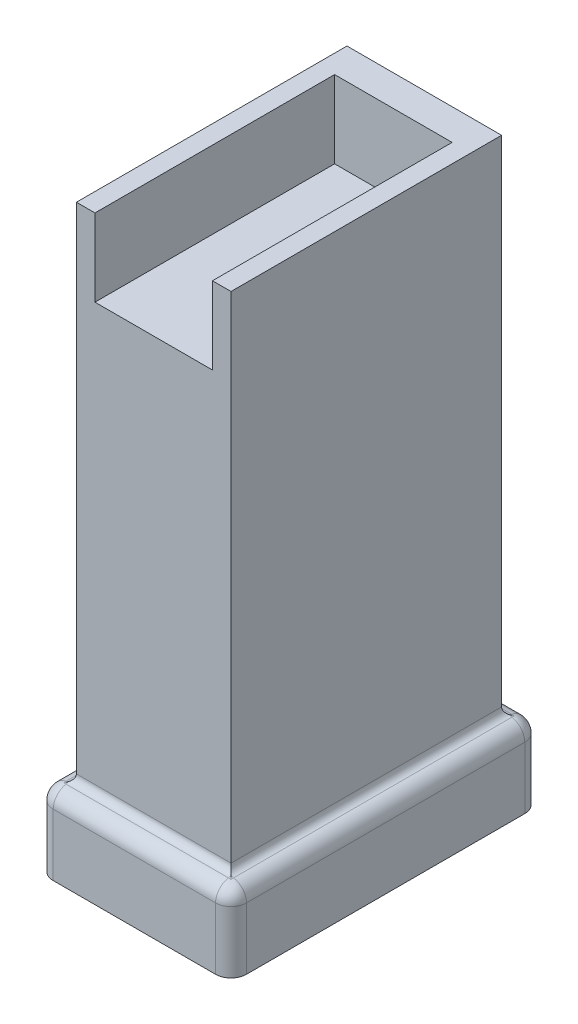
ISO-10303-21;
HEADER;
FILE_DESCRIPTION(('STEP AP214'),'2;1');
FILE_NAME('part.step','',(''),(''),'','','');
FILE_SCHEMA(('AUTOMOTIVE_DESIGN { 1 0 10303 214 1 1 1 1 }'));
ENDSEC;
DATA;
#1=APPLICATION_CONTEXT('core data for automotive mechanical design processes');
#2=APPLICATION_PROTOCOL_DEFINITION('international standard','automotive_design',2000,#1);
#3=PRODUCT_CONTEXT('',#1,'mechanical');
#4=PRODUCT('Part','Part','',(#3));
#5=PRODUCT_RELATED_PRODUCT_CATEGORY('part','',(#4));
#6=PRODUCT_DEFINITION_FORMATION('','',#4);
#7=PRODUCT_DEFINITION_CONTEXT('part definition',#1,'design');
#8=PRODUCT_DEFINITION('design','',#6,#7);
#9=PRODUCT_DEFINITION_SHAPE('','',#8);
#10=(LENGTH_UNIT() NAMED_UNIT(*) SI_UNIT(.MILLI.,.METRE.));
#11=(NAMED_UNIT(*) PLANE_ANGLE_UNIT() SI_UNIT($,.RADIAN.));
#12=(NAMED_UNIT(*) SI_UNIT($,.STERADIAN.) SOLID_ANGLE_UNIT());
#13=UNCERTAINTY_MEASURE_WITH_UNIT(LENGTH_MEASURE(1.E-05),#10,'distance_accuracy_value','');
#14=(GEOMETRIC_REPRESENTATION_CONTEXT(3) GLOBAL_UNCERTAINTY_ASSIGNED_CONTEXT((#13)) GLOBAL_UNIT_ASSIGNED_CONTEXT((#10,
#11,#12)) REPRESENTATION_CONTEXT('',''));
#15=CARTESIAN_POINT('',(0.,0.,0.));
#16=DIRECTION('',(0.,0.,1.));
#17=DIRECTION('',(1.,0.,0.));
#18=AXIS2_PLACEMENT_3D('',#15,#16,#17);
#19=CARTESIAN_POINT('',(-12.5,10.,20.));
#20=DIRECTION('',(1.,0.,0.));
#21=DIRECTION('',(0.,0.,-1.));
#22=AXIS2_PLACEMENT_3D('',#19,#20,#21);
#23=PLANE('',#22);
#24=DIRECTION('',(0.,0.,1.));
#25=VECTOR('',#24,1.);
#26=CARTESIAN_POINT('',(-12.5,8.,-20.));
#27=LINE('',#26,#25);
#28=CARTESIAN_POINT('',(-12.5,8.,18.));
#29=VERTEX_POINT('',#28);
#30=CARTESIAN_POINT('',(-12.5,8.,-18.));
#31=VERTEX_POINT('',#30);
#32=EDGE_CURVE('E590',#29,#31,#27,.F.);
#33=ORIENTED_EDGE('',*,*,#32,.T.);
#34=DIRECTION('',(0.,-1.,0.));
#35=VECTOR('',#34,1.);
#36=CARTESIAN_POINT('',(-12.5,10.,-18.));
#37=LINE('',#36,#35);
#38=CARTESIAN_POINT('',(-12.5,0.,-18.));
#39=VERTEX_POINT('',#38);
#40=EDGE_CURVE('E408',#31,#39,#37,.T.);
#41=ORIENTED_EDGE('',*,*,#40,.T.);
#42=DIRECTION('',(0.,0.,1.));
#43=VECTOR('',#42,1.);
#44=CARTESIAN_POINT('',(-12.5,0.,20.));
#45=LINE('',#44,#43);
#46=CARTESIAN_POINT('',(-12.5,0.,18.));
#47=VERTEX_POINT('',#46);
#48=EDGE_CURVE('E463',#39,#47,#45,.T.);
#49=ORIENTED_EDGE('',*,*,#48,.T.);
#50=DIRECTION('',(0.,-1.,0.));
#51=VECTOR('',#50,1.);
#52=CARTESIAN_POINT('',(-12.5,10.,18.));
#53=LINE('',#52,#51);
#54=EDGE_CURVE('E586',#47,#29,#53,.F.);
#55=ORIENTED_EDGE('',*,*,#54,.T.);
#56=EDGE_LOOP('',(#33,#41,#49,#55));
#57=FACE_BOUND('',#56,.T.);
#58=ADVANCED_FACE('F45',(#57),#23,.F.);
#59=CARTESIAN_POINT('',(12.5,10.,20.));
#60=DIRECTION('',(0.,0.,-1.));
#61=DIRECTION('',(-1.,0.,0.));
#62=AXIS2_PLACEMENT_3D('',#59,#60,#61);
#63=PLANE('',#62);
#64=DIRECTION('',(1.,0.,0.));
#65=VECTOR('',#64,1.);
#66=CARTESIAN_POINT('',(12.5,0.,20.));
#67=LINE('',#66,#65);
#68=CARTESIAN_POINT('',(-10.5,0.,20.));
#69=VERTEX_POINT('',#68);
#70=CARTESIAN_POINT('',(10.5,0.,20.));
#71=VERTEX_POINT('',#70);
#72=EDGE_CURVE('E549',#69,#71,#67,.T.);
#73=ORIENTED_EDGE('',*,*,#72,.T.);
#74=DIRECTION('',(0.,-1.,0.));
#75=VECTOR('',#74,1.);
#76=CARTESIAN_POINT('',(10.5,10.,20.));
#77=LINE('',#76,#75);
#78=CARTESIAN_POINT('',(10.5,8.,20.));
#79=VERTEX_POINT('',#78);
#80=EDGE_CURVE('E567',#71,#79,#77,.F.);
#81=ORIENTED_EDGE('',*,*,#80,.T.);
#82=DIRECTION('',(1.,0.,0.));
#83=VECTOR('',#82,1.);
#84=CARTESIAN_POINT('',(-12.5,8.,20.));
#85=LINE('',#84,#83);
#86=CARTESIAN_POINT('',(-10.5,8.,20.));
#87=VERTEX_POINT('',#86);
#88=EDGE_CURVE('E563',#79,#87,#85,.F.);
#89=ORIENTED_EDGE('',*,*,#88,.T.);
#90=DIRECTION('',(0.,-1.,0.));
#91=VECTOR('',#90,1.);
#92=CARTESIAN_POINT('',(-10.5,10.,20.));
#93=LINE('',#92,#91);
#94=EDGE_CURVE('E560',#87,#69,#93,.T.);
#95=ORIENTED_EDGE('',*,*,#94,.T.);
#96=EDGE_LOOP('',(#73,#81,#89,#95));
#97=FACE_BOUND('',#96,.T.);
#98=ADVANCED_FACE('F342',(#97),#63,.F.);
#99=CARTESIAN_POINT('',(12.5,10.,20.));
#100=DIRECTION('',(-1.,0.,0.));
#101=DIRECTION('',(0.,0.,1.));
#102=AXIS2_PLACEMENT_3D('',#99,#100,#101);
#103=PLANE('',#102);
#104=DIRECTION('',(0.,0.,-1.));
#105=VECTOR('',#104,1.);
#106=CARTESIAN_POINT('',(12.5,0.,20.));
#107=LINE('',#106,#105);
#108=CARTESIAN_POINT('',(12.5,0.,18.));
#109=VERTEX_POINT('',#108);
#110=CARTESIAN_POINT('',(12.5,0.,-18.));
#111=VERTEX_POINT('',#110);
#112=EDGE_CURVE('E553',#109,#111,#107,.T.);
#113=ORIENTED_EDGE('',*,*,#112,.T.);
#114=DIRECTION('',(0.,-1.,0.));
#115=VECTOR('',#114,1.);
#116=CARTESIAN_POINT('',(12.5,10.,-18.));
#117=LINE('',#116,#115);
#118=CARTESIAN_POINT('',(12.5,8.,-18.));
#119=VERTEX_POINT('',#118);
#120=EDGE_CURVE('E576',#111,#119,#117,.F.);
#121=ORIENTED_EDGE('',*,*,#120,.T.);
#122=DIRECTION('',(0.,0.,-1.));
#123=VECTOR('',#122,1.);
#124=CARTESIAN_POINT('',(12.5,8.,20.));
#125=LINE('',#124,#123);
#126=CARTESIAN_POINT('',(12.5,8.,18.));
#127=VERTEX_POINT('',#126);
#128=EDGE_CURVE('E573',#119,#127,#125,.F.);
#129=ORIENTED_EDGE('',*,*,#128,.T.);
#130=DIRECTION('',(0.,-1.,0.));
#131=VECTOR('',#130,1.);
#132=CARTESIAN_POINT('',(12.5,10.,18.));
#133=LINE('',#132,#131);
#134=EDGE_CURVE('E570',#127,#109,#133,.T.);
#135=ORIENTED_EDGE('',*,*,#134,.T.);
#136=EDGE_LOOP('',(#113,#121,#129,#135));
#137=FACE_BOUND('',#136,.T.);
#138=ADVANCED_FACE('F348',(#137),#103,.F.);
#139=CARTESIAN_POINT('',(12.5,10.,-20.));
#140=DIRECTION('',(0.,0.,1.));
#141=DIRECTION('',(1.,0.,0.));
#142=AXIS2_PLACEMENT_3D('',#139,#140,#141);
#143=PLANE('',#142);
#144=DIRECTION('',(-1.,0.,0.));
#145=VECTOR('',#144,1.);
#146=CARTESIAN_POINT('',(12.5,0.,-20.));
#147=LINE('',#146,#145);
#148=CARTESIAN_POINT('',(10.5,0.,-20.));
#149=VERTEX_POINT('',#148);
#150=CARTESIAN_POINT('',(-10.5,0.,-20.));
#151=VERTEX_POINT('',#150);
#152=EDGE_CURVE('E557',#149,#151,#147,.T.);
#153=ORIENTED_EDGE('',*,*,#152,.T.);
#154=DIRECTION('',(0.,-1.,0.));
#155=VECTOR('',#154,1.);
#156=CARTESIAN_POINT('',(-10.5,10.,-20.));
#157=LINE('',#156,#155);
#158=CARTESIAN_POINT('',(-10.5,8.,-20.));
#159=VERTEX_POINT('',#158);
#160=EDGE_CURVE('E409',#151,#159,#157,.F.);
#161=ORIENTED_EDGE('',*,*,#160,.T.);
#162=DIRECTION('',(-1.,0.,0.));
#163=VECTOR('',#162,1.);
#164=CARTESIAN_POINT('',(12.5,8.,-20.));
#165=LINE('',#164,#163);
#166=CARTESIAN_POINT('',(10.5,8.,-20.));
#167=VERTEX_POINT('',#166);
#168=EDGE_CURVE('E229',#159,#167,#165,.F.);
#169=ORIENTED_EDGE('',*,*,#168,.T.);
#170=DIRECTION('',(0.,-1.,0.));
#171=VECTOR('',#170,1.);
#172=CARTESIAN_POINT('',(10.5,10.,-20.));
#173=LINE('',#172,#171);
#174=EDGE_CURVE('E579',#167,#149,#173,.T.);
#175=ORIENTED_EDGE('',*,*,#174,.T.);
#176=EDGE_LOOP('',(#153,#161,#169,#175));
#177=FACE_BOUND('',#176,.T.);
#178=ADVANCED_FACE('F401',(#177),#143,.F.);
#179=CARTESIAN_POINT('',(0.,0.,0.));
#180=DIRECTION('',(0.,1.,0.));
#181=DIRECTION('',(0.,0.,1.));
#182=AXIS2_PLACEMENT_3D('',#179,#180,#181);
#183=PLANE('',#182);
#184=ORIENTED_EDGE('',*,*,#48,.F.);
#185=CARTESIAN_POINT('',(-10.5,0.,-18.));
#186=DIRECTION('',(0.,1.,0.));
#187=DIRECTION('',(0.,0.,1.));
#188=AXIS2_PLACEMENT_3D('',#185,#186,#187);
#189=CIRCLE('',#188,2.);
#190=EDGE_CURVE('E407',#39,#151,#189,.F.);
#191=ORIENTED_EDGE('',*,*,#190,.T.);
#192=ORIENTED_EDGE('',*,*,#152,.F.);
#193=CARTESIAN_POINT('',(10.5,0.,-18.));
#194=DIRECTION('',(0.,1.,0.));
#195=DIRECTION('',(0.,0.,1.));
#196=AXIS2_PLACEMENT_3D('',#193,#194,#195);
#197=CIRCLE('',#196,2.);
#198=EDGE_CURVE('E415',#149,#111,#197,.F.);
#199=ORIENTED_EDGE('',*,*,#198,.T.);
#200=ORIENTED_EDGE('',*,*,#112,.F.);
#201=CARTESIAN_POINT('',(10.5,0.,18.));
#202=DIRECTION('',(0.,1.,0.));
#203=DIRECTION('',(0.,0.,1.));
#204=AXIS2_PLACEMENT_3D('',#201,#202,#203);
#205=CIRCLE('',#204,2.);
#206=EDGE_CURVE('E422',#109,#71,#205,.F.);
#207=ORIENTED_EDGE('',*,*,#206,.T.);
#208=ORIENTED_EDGE('',*,*,#72,.F.);
#209=CARTESIAN_POINT('',(-10.5,0.,18.));
#210=DIRECTION('',(0.,1.,0.));
#211=DIRECTION('',(0.,0.,1.));
#212=AXIS2_PLACEMENT_3D('',#209,#210,#211);
#213=CIRCLE('',#212,2.);
#214=EDGE_CURVE('E595',#69,#47,#213,.F.);
#215=ORIENTED_EDGE('',*,*,#214,.T.);
#216=EDGE_LOOP('',(#184,#191,#192,#199,#200,#207,#208,#215));
#217=FACE_BOUND('',#216,.T.);
#218=ADVANCED_FACE('F396',(#217),#183,.F.);
#219=CARTESIAN_POINT('',(-10.5,10.,-18.));
#220=DIRECTION('',(0.,-1.,0.));
#221=DIRECTION('',(0.,0.,-1.));
#222=AXIS2_PLACEMENT_3D('',#219,#220,#221);
#223=CYLINDRICAL_SURFACE('',#222,2.);
#224=ORIENTED_EDGE('',*,*,#190,.F.);
#225=ORIENTED_EDGE('',*,*,#40,.F.);
#226=CARTESIAN_POINT('',(-10.5,8.,-18.));
#227=DIRECTION('',(0.,1.,0.));
#228=DIRECTION('',(0.,0.,1.));
#229=AXIS2_PLACEMENT_3D('',#226,#227,#228);
#230=CIRCLE('',#229,2.);
#231=EDGE_CURVE('E232',#159,#31,#230,.T.);
#232=ORIENTED_EDGE('',*,*,#231,.F.);
#233=ORIENTED_EDGE('',*,*,#160,.F.);
#234=EDGE_LOOP('',(#224,#225,#232,#233));
#235=FACE_BOUND('',#234,.T.);
#236=ADVANCED_FACE('F394',(#235),#223,.T.);
#237=CARTESIAN_POINT('',(0.,8.,-18.));
#238=DIRECTION('',(1.,0.,0.));
#239=DIRECTION('',(0.,0.,-1.));
#240=AXIS2_PLACEMENT_3D('',#237,#238,#239);
#241=CYLINDRICAL_SURFACE('',#240,2.);
#242=CARTESIAN_POINT('',(-10.5,8.,-18.));
#243=DIRECTION('',(-1.,0.,0.));
#244=DIRECTION('',(0.,0.,1.));
#245=AXIS2_PLACEMENT_3D('',#242,#243,#244);
#246=CIRCLE('',#245,2.);
#247=CARTESIAN_POINT('',(-10.5,9.97202659436654,-18.3333333333333));
#248=VERTEX_POINT('',#247);
#249=EDGE_CURVE('E218',#248,#159,#246,.T.);
#250=ORIENTED_EDGE('',*,*,#249,.F.);
#251=DIRECTION('',(1.,0.,0.));
#252=VECTOR('',#251,1.);
#253=CARTESIAN_POINT('',(0.,9.97202659436654,-18.3333333333333));
#254=LINE('',#253,#252);
#255=CARTESIAN_POINT('',(10.5,9.97202659436654,-18.3333333333333));
#256=VERTEX_POINT('',#255);
#257=EDGE_CURVE('E221',#248,#256,#254,.T.);
#258=ORIENTED_EDGE('',*,*,#257,.T.);
#259=CARTESIAN_POINT('',(10.5,8.,-18.));
#260=DIRECTION('',(1.,0.,0.));
#261=DIRECTION('',(0.,0.,-1.));
#262=AXIS2_PLACEMENT_3D('',#259,#260,#261);
#263=CIRCLE('',#262,2.);
#264=EDGE_CURVE('E233',#167,#256,#263,.T.);
#265=ORIENTED_EDGE('',*,*,#264,.F.);
#266=ORIENTED_EDGE('',*,*,#168,.F.);
#267=EDGE_LOOP('',(#250,#258,#265,#266));
#268=FACE_BOUND('',#267,.T.);
#269=ADVANCED_FACE('F225',(#268),#241,.T.);
#270=CARTESIAN_POINT('',(10.5,10.,-18.));
#271=DIRECTION('',(0.,-1.,0.));
#272=DIRECTION('',(0.,0.,-1.));
#273=AXIS2_PLACEMENT_3D('',#270,#271,#272);
#274=CYLINDRICAL_SURFACE('',#273,2.);
#275=ORIENTED_EDGE('',*,*,#198,.F.);
#276=ORIENTED_EDGE('',*,*,#174,.F.);
#277=CARTESIAN_POINT('',(10.5,8.,-18.));
#278=DIRECTION('',(0.,1.,0.));
#279=DIRECTION('',(0.,0.,1.));
#280=AXIS2_PLACEMENT_3D('',#277,#278,#279);
#281=CIRCLE('',#280,2.);
#282=EDGE_CURVE('E456',#119,#167,#281,.T.);
#283=ORIENTED_EDGE('',*,*,#282,.F.);
#284=ORIENTED_EDGE('',*,*,#120,.F.);
#285=EDGE_LOOP('',(#275,#276,#283,#284));
#286=FACE_BOUND('',#285,.T.);
#287=ADVANCED_FACE('F389',(#286),#274,.T.);
#288=CARTESIAN_POINT('',(-10.5,8.,-18.));
#289=DIRECTION('',(0.,0.,-1.));
#290=DIRECTION('',(-1.,0.,0.));
#291=AXIS2_PLACEMENT_3D('',#288,#289,#290);
#292=SPHERICAL_SURFACE('',#291,2.);
#293=CARTESIAN_POINT('',(-10.8333333333333,8.,-18.));
#294=DIRECTION('',(1.,0.,0.));
#295=DIRECTION('',(0.,0.,-1.));
#296=AXIS2_PLACEMENT_3D('',#293,#294,#295);
#297=CIRCLE('',#296,1.97202659436654);
#298=CARTESIAN_POINT('',(-10.8333333333333,9.97202659436654,-18.));
#299=VERTEX_POINT('',#298);
#300=CARTESIAN_POINT('',(-10.8333333333333,9.9436506316151,-18.3333333333333));
#301=VERTEX_POINT('',#300);
#302=EDGE_CURVE('E70',#299,#301,#297,.F.);
#303=ORIENTED_EDGE('',*,*,#302,.T.);
#304=CARTESIAN_POINT('',(-10.5,8.,-18.3333333333333));
#305=DIRECTION('',(0.,0.,1.));
#306=DIRECTION('',(1.,0.,0.));
#307=AXIS2_PLACEMENT_3D('',#304,#305,#306);
#308=CIRCLE('',#307,1.97202659436654);
#309=EDGE_CURVE('E214',#301,#248,#308,.F.);
#310=ORIENTED_EDGE('',*,*,#309,.T.);
#311=ORIENTED_EDGE('',*,*,#249,.T.);
#312=ORIENTED_EDGE('',*,*,#231,.T.);
#313=CARTESIAN_POINT('',(-10.5,8.,-18.));
#314=DIRECTION('',(0.,0.,-1.));
#315=DIRECTION('',(0.,1.,0.));
#316=AXIS2_PLACEMENT_3D('',#313,#314,#315);
#317=CIRCLE('',#316,2.);
#318=EDGE_CURVE('E453',#299,#31,#317,.F.);
#319=ORIENTED_EDGE('',*,*,#318,.F.);
#320=EDGE_LOOP('',(#303,#310,#311,#312,#319));
#321=FACE_BOUND('',#320,.T.);
#322=ADVANCED_FACE('F216',(#321),#292,.T.);
#323=CARTESIAN_POINT('',(10.5,8.,-18.));
#324=DIRECTION('',(0.,0.,-1.));
#325=DIRECTION('',(-1.,0.,0.));
#326=AXIS2_PLACEMENT_3D('',#323,#324,#325);
#327=SPHERICAL_SURFACE('',#326,2.);
#328=CARTESIAN_POINT('',(10.5,8.,-18.3333333333333));
#329=DIRECTION('',(0.,0.,1.));
#330=DIRECTION('',(1.,0.,0.));
#331=AXIS2_PLACEMENT_3D('',#328,#329,#330);
#332=CIRCLE('',#331,1.97202659436654);
#333=CARTESIAN_POINT('',(10.8333333333333,9.9436506316151,-18.3333333333333));
#334=VERTEX_POINT('',#333);
#335=EDGE_CURVE('E483',#256,#334,#332,.F.);
#336=ORIENTED_EDGE('',*,*,#335,.T.);
#337=CARTESIAN_POINT('',(10.8333333333333,8.,-18.));
#338=DIRECTION('',(-1.,0.,0.));
#339=DIRECTION('',(0.,0.,1.));
#340=AXIS2_PLACEMENT_3D('',#337,#338,#339);
#341=CIRCLE('',#340,1.97202659436654);
#342=CARTESIAN_POINT('',(10.8333333333333,9.97202659436654,-18.));
#343=VERTEX_POINT('',#342);
#344=EDGE_CURVE('E486',#334,#343,#341,.F.);
#345=ORIENTED_EDGE('',*,*,#344,.T.);
#346=CARTESIAN_POINT('',(10.5,8.,-18.));
#347=DIRECTION('',(0.,0.,-1.));
#348=DIRECTION('',(-1.,0.,0.));
#349=AXIS2_PLACEMENT_3D('',#346,#347,#348);
#350=CIRCLE('',#349,2.);
#351=EDGE_CURVE('E449',#119,#343,#350,.F.);
#352=ORIENTED_EDGE('',*,*,#351,.F.);
#353=ORIENTED_EDGE('',*,*,#282,.T.);
#354=ORIENTED_EDGE('',*,*,#264,.T.);
#355=EDGE_LOOP('',(#336,#345,#352,#353,#354));
#356=FACE_BOUND('',#355,.T.);
#357=ADVANCED_FACE('F382',(#356),#327,.T.);
#358=CARTESIAN_POINT('',(-10.5,10.,18.));
#359=DIRECTION('',(0.,-1.,0.));
#360=DIRECTION('',(0.,0.,-1.));
#361=AXIS2_PLACEMENT_3D('',#358,#359,#360);
#362=CYLINDRICAL_SURFACE('',#361,2.);
#363=ORIENTED_EDGE('',*,*,#214,.F.);
#364=ORIENTED_EDGE('',*,*,#94,.F.);
#365=CARTESIAN_POINT('',(-10.5,8.,18.));
#366=DIRECTION('',(0.,1.,0.));
#367=DIRECTION('',(0.,0.,1.));
#368=AXIS2_PLACEMENT_3D('',#365,#366,#367);
#369=CIRCLE('',#368,2.);
#370=EDGE_CURVE('E445',#29,#87,#369,.T.);
#371=ORIENTED_EDGE('',*,*,#370,.F.);
#372=ORIENTED_EDGE('',*,*,#54,.F.);
#373=EDGE_LOOP('',(#363,#364,#371,#372));
#374=FACE_BOUND('',#373,.T.);
#375=ADVANCED_FACE('F378',(#374),#362,.T.);
#376=CARTESIAN_POINT('',(-10.5,8.,0.));
#377=DIRECTION('',(0.,0.,-1.));
#378=DIRECTION('',(-1.,0.,0.));
#379=AXIS2_PLACEMENT_3D('',#376,#377,#378);
#380=CYLINDRICAL_SURFACE('',#379,2.);
#381=CARTESIAN_POINT('',(-10.5,8.,18.));
#382=DIRECTION('',(0.,0.,1.));
#383=DIRECTION('',(1.,0.,0.));
#384=AXIS2_PLACEMENT_3D('',#381,#382,#383);
#385=CIRCLE('',#384,2.);
#386=CARTESIAN_POINT('',(-10.8333333333333,9.97202659436654,18.));
#387=VERTEX_POINT('',#386);
#388=EDGE_CURVE('E442',#387,#29,#385,.T.);
#389=ORIENTED_EDGE('',*,*,#388,.F.);
#390=DIRECTION('',(0.,0.,-1.));
#391=VECTOR('',#390,1.);
#392=CARTESIAN_POINT('',(-10.8333333333333,9.97202659436654,0.));
#393=LINE('',#392,#391);
#394=EDGE_CURVE('E11',#387,#299,#393,.T.);
#395=ORIENTED_EDGE('',*,*,#394,.T.);
#396=ORIENTED_EDGE('',*,*,#318,.T.);
#397=ORIENTED_EDGE('',*,*,#32,.F.);
#398=EDGE_LOOP('',(#389,#395,#396,#397));
#399=FACE_BOUND('',#398,.T.);
#400=ADVANCED_FACE('F374',(#399),#380,.T.);
#401=CARTESIAN_POINT('',(10.5,8.,0.));
#402=DIRECTION('',(0.,0.,1.));
#403=DIRECTION('',(1.,0.,0.));
#404=AXIS2_PLACEMENT_3D('',#401,#402,#403);
#405=CYLINDRICAL_SURFACE('',#404,2.);
#406=ORIENTED_EDGE('',*,*,#351,.T.);
#407=DIRECTION('',(0.,0.,1.));
#408=VECTOR('',#407,1.);
#409=CARTESIAN_POINT('',(10.8333333333333,9.97202659436654,0.));
#410=LINE('',#409,#408);
#411=CARTESIAN_POINT('',(10.8333333333333,9.97202659436654,18.));
#412=VERTEX_POINT('',#411);
#413=EDGE_CURVE('E489',#343,#412,#410,.T.);
#414=ORIENTED_EDGE('',*,*,#413,.T.);
#415=CARTESIAN_POINT('',(10.5,8.,18.));
#416=DIRECTION('',(0.,0.,1.));
#417=DIRECTION('',(1.,0.,0.));
#418=AXIS2_PLACEMENT_3D('',#415,#416,#417);
#419=CIRCLE('',#418,2.);
#420=EDGE_CURVE('E438',#127,#412,#419,.T.);
#421=ORIENTED_EDGE('',*,*,#420,.F.);
#422=ORIENTED_EDGE('',*,*,#128,.F.);
#423=EDGE_LOOP('',(#406,#414,#421,#422));
#424=FACE_BOUND('',#423,.T.);
#425=ADVANCED_FACE('F370',(#424),#405,.T.);
#426=CARTESIAN_POINT('',(10.5,10.,18.));
#427=DIRECTION('',(0.,-1.,0.));
#428=DIRECTION('',(0.,0.,-1.));
#429=AXIS2_PLACEMENT_3D('',#426,#427,#428);
#430=CYLINDRICAL_SURFACE('',#429,2.);
#431=ORIENTED_EDGE('',*,*,#206,.F.);
#432=ORIENTED_EDGE('',*,*,#134,.F.);
#433=CARTESIAN_POINT('',(10.5,8.,18.));
#434=DIRECTION('',(0.,1.,0.));
#435=DIRECTION('',(0.,0.,1.));
#436=AXIS2_PLACEMENT_3D('',#433,#434,#435);
#437=CIRCLE('',#436,2.);
#438=EDGE_CURVE('E434',#79,#127,#437,.T.);
#439=ORIENTED_EDGE('',*,*,#438,.F.);
#440=ORIENTED_EDGE('',*,*,#80,.F.);
#441=EDGE_LOOP('',(#431,#432,#439,#440));
#442=FACE_BOUND('',#441,.T.);
#443=ADVANCED_FACE('F366',(#442),#430,.T.);
#444=CARTESIAN_POINT('',(-10.5,8.,18.));
#445=DIRECTION('',(-1.,0.,0.));
#446=DIRECTION('',(0.,0.,1.));
#447=AXIS2_PLACEMENT_3D('',#444,#445,#446);
#448=SPHERICAL_SURFACE('',#447,2.);
#449=CARTESIAN_POINT('',(-10.5,8.,18.));
#450=DIRECTION('',(-1.,0.,0.));
#451=DIRECTION('',(0.,-1.,0.));
#452=AXIS2_PLACEMENT_3D('',#449,#450,#451);
#453=CIRCLE('',#452,2.);
#454=CARTESIAN_POINT('',(-10.5,9.97202659436654,18.3333333333333));
#455=VERTEX_POINT('',#454);
#456=EDGE_CURVE('E430',#455,#87,#453,.F.);
#457=ORIENTED_EDGE('',*,*,#456,.F.);
#458=CARTESIAN_POINT('',(-10.5,8.,18.3333333333333));
#459=DIRECTION('',(0.,0.,-1.));
#460=DIRECTION('',(-1.,0.,0.));
#461=AXIS2_PLACEMENT_3D('',#458,#459,#460);
#462=CIRCLE('',#461,1.97202659436654);
#463=CARTESIAN_POINT('',(-10.8333333333333,9.9436506316151,18.3333333333333));
#464=VERTEX_POINT('',#463);
#465=EDGE_CURVE('E476',#455,#464,#462,.F.);
#466=ORIENTED_EDGE('',*,*,#465,.T.);
#467=CARTESIAN_POINT('',(-10.8333333333333,8.,18.));
#468=DIRECTION('',(1.,0.,0.));
#469=DIRECTION('',(0.,0.,-1.));
#470=AXIS2_PLACEMENT_3D('',#467,#468,#469);
#471=CIRCLE('',#470,1.97202659436654);
#472=EDGE_CURVE('E473',#464,#387,#471,.F.);
#473=ORIENTED_EDGE('',*,*,#472,.T.);
#474=ORIENTED_EDGE('',*,*,#388,.T.);
#475=ORIENTED_EDGE('',*,*,#370,.T.);
#476=EDGE_LOOP('',(#457,#466,#473,#474,#475));
#477=FACE_BOUND('',#476,.T.);
#478=ADVANCED_FACE('F362',(#477),#448,.T.);
#479=CARTESIAN_POINT('',(10.5,8.,18.));
#480=DIRECTION('',(1.,0.,0.));
#481=DIRECTION('',(0.,0.,-1.));
#482=AXIS2_PLACEMENT_3D('',#479,#480,#481);
#483=SPHERICAL_SURFACE('',#482,2.);
#484=CARTESIAN_POINT('',(10.8333333333333,8.,18.));
#485=DIRECTION('',(-1.,0.,0.));
#486=DIRECTION('',(0.,0.,1.));
#487=AXIS2_PLACEMENT_3D('',#484,#485,#486);
#488=CIRCLE('',#487,1.97202659436654);
#489=CARTESIAN_POINT('',(10.8333333333333,9.9436506316151,18.3333333333333));
#490=VERTEX_POINT('',#489);
#491=EDGE_CURVE('E420',#412,#490,#488,.F.);
#492=ORIENTED_EDGE('',*,*,#491,.T.);
#493=CARTESIAN_POINT('',(10.5,8.,18.3333333333333));
#494=DIRECTION('',(0.,0.,-1.));
#495=DIRECTION('',(-1.,0.,0.));
#496=AXIS2_PLACEMENT_3D('',#493,#494,#495);
#497=CIRCLE('',#496,1.97202659436654);
#498=CARTESIAN_POINT('',(10.5,9.97202659436654,18.3333333333333));
#499=VERTEX_POINT('',#498);
#500=EDGE_CURVE('E467',#490,#499,#497,.F.);
#501=ORIENTED_EDGE('',*,*,#500,.T.);
#502=CARTESIAN_POINT('',(10.5,8.,18.));
#503=DIRECTION('',(1.,0.,0.));
#504=DIRECTION('',(0.,0.,-1.));
#505=AXIS2_PLACEMENT_3D('',#502,#503,#504);
#506=CIRCLE('',#505,2.);
#507=EDGE_CURVE('E426',#79,#499,#506,.F.);
#508=ORIENTED_EDGE('',*,*,#507,.F.);
#509=ORIENTED_EDGE('',*,*,#438,.T.);
#510=ORIENTED_EDGE('',*,*,#420,.T.);
#511=EDGE_LOOP('',(#492,#501,#508,#509,#510));
#512=FACE_BOUND('',#511,.T.);
#513=ADVANCED_FACE('F358',(#512),#483,.T.);
#514=CARTESIAN_POINT('',(0.,8.,18.));
#515=DIRECTION('',(-1.,0.,0.));
#516=DIRECTION('',(0.,0.,1.));
#517=AXIS2_PLACEMENT_3D('',#514,#515,#516);
#518=CYLINDRICAL_SURFACE('',#517,2.);
#519=ORIENTED_EDGE('',*,*,#507,.T.);
#520=DIRECTION('',(-1.,0.,0.));
#521=VECTOR('',#520,1.);
#522=CARTESIAN_POINT('',(0.,9.97202659436654,18.3333333333333));
#523=LINE('',#522,#521);
#524=EDGE_CURVE('E470',#499,#455,#523,.T.);
#525=ORIENTED_EDGE('',*,*,#524,.T.);
#526=ORIENTED_EDGE('',*,*,#456,.T.);
#527=ORIENTED_EDGE('',*,*,#88,.F.);
#528=EDGE_LOOP('',(#519,#525,#526,#527));
#529=FACE_BOUND('',#528,.T.);
#530=ADVANCED_FACE('F354',(#529),#518,.T.);
#531=CARTESIAN_POINT('',(-10.,75.,17.5));
#532=DIRECTION('',(1.,0.,0.));
#533=DIRECTION('',(0.,0.,-1.));
#534=AXIS2_PLACEMENT_3D('',#531,#532,#533);
#535=PLANE('',#534);
#536=DIRECTION('',(0.,-1.,0.));
#537=VECTOR('',#536,1.);
#538=CARTESIAN_POINT('',(-10.,75.,-17.5));
#539=LINE('',#538,#537);
#540=CARTESIAN_POINT('',(-10.,75.,-17.5));
#541=VERTEX_POINT('',#540);
#542=CARTESIAN_POINT('',(-10.,10.9580398915498,-17.5));
#543=VERTEX_POINT('',#542);
#544=EDGE_CURVE('E502',#541,#543,#539,.T.);
#545=ORIENTED_EDGE('',*,*,#544,.T.);
#546=DIRECTION('',(0.,0.,-1.));
#547=VECTOR('',#546,1.);
#548=CARTESIAN_POINT('',(-10.,10.9580398915498,17.5));
#549=LINE('',#548,#547);
#550=CARTESIAN_POINT('',(-10.,10.9580398915498,17.5));
#551=VERTEX_POINT('',#550);
#552=EDGE_CURVE('E61',#543,#551,#549,.F.);
#553=ORIENTED_EDGE('',*,*,#552,.T.);
#554=DIRECTION('',(0.,-1.,0.));
#555=VECTOR('',#554,1.);
#556=CARTESIAN_POINT('',(-10.,75.,17.5));
#557=LINE('',#556,#555);
#558=CARTESIAN_POINT('',(-10.,75.,17.5));
#559=VERTEX_POINT('',#558);
#560=EDGE_CURVE('E431',#559,#551,#557,.T.);
#561=ORIENTED_EDGE('',*,*,#560,.F.);
#562=DIRECTION('',(0.,0.,1.));
#563=VECTOR('',#562,1.);
#564=CARTESIAN_POINT('',(-10.,75.,17.5));
#565=LINE('',#564,#563);
#566=EDGE_CURVE('E511',#541,#559,#565,.T.);
#567=ORIENTED_EDGE('',*,*,#566,.F.);
#568=EDGE_LOOP('',(#545,#553,#561,#567));
#569=FACE_BOUND('',#568,.T.);
#570=ADVANCED_FACE('F357',(#569),#535,.F.);
#571=CARTESIAN_POINT('',(10.,75.,17.5));
#572=DIRECTION('',(0.,0.,-1.));
#573=DIRECTION('',(-1.,0.,0.));
#574=AXIS2_PLACEMENT_3D('',#571,#572,#573);
#575=PLANE('',#574);
#576=ORIENTED_EDGE('',*,*,#560,.T.);
#577=DIRECTION('',(-1.,0.,0.));
#578=VECTOR('',#577,1.);
#579=CARTESIAN_POINT('',(10.,10.9580398915498,17.5));
#580=LINE('',#579,#578);
#581=CARTESIAN_POINT('',(10.,10.9580398915498,17.5));
#582=VERTEX_POINT('',#581);
#583=EDGE_CURVE('E414',#551,#582,#580,.F.);
#584=ORIENTED_EDGE('',*,*,#583,.T.);
#585=DIRECTION('',(0.,-1.,0.));
#586=VECTOR('',#585,1.);
#587=CARTESIAN_POINT('',(10.,75.,17.5));
#588=LINE('',#587,#586);
#589=CARTESIAN_POINT('',(10.,75.,17.5));
#590=VERTEX_POINT('',#589);
#591=EDGE_CURVE('E534',#590,#582,#588,.T.);
#592=ORIENTED_EDGE('',*,*,#591,.F.);
#593=DIRECTION('',(1.,0.,0.));
#594=VECTOR('',#593,1.);
#595=CARTESIAN_POINT('',(10.,75.,17.5));
#596=LINE('',#595,#594);
#597=CARTESIAN_POINT('',(7.59999999999999,75.,17.5));
#598=VERTEX_POINT('',#597);
#599=EDGE_CURVE('E656',#598,#590,#596,.T.);
#600=ORIENTED_EDGE('',*,*,#599,.F.);
#601=DIRECTION('',(0.,1.,0.));
#602=VECTOR('',#601,1.);
#603=CARTESIAN_POINT('',(7.59999999999999,65.,17.5));
#604=LINE('',#603,#602);
#605=CARTESIAN_POINT('',(7.59999999999999,65.,17.5));
#606=VERTEX_POINT('',#605);
#607=EDGE_CURVE('E642',#606,#598,#604,.T.);
#608=ORIENTED_EDGE('',*,*,#607,.F.);
#609=DIRECTION('',(1.,0.,0.));
#610=VECTOR('',#609,1.);
#611=CARTESIAN_POINT('',(7.59999999999999,65.,17.5));
#612=LINE('',#611,#610);
#613=CARTESIAN_POINT('',(-7.60000000000001,65.,17.5));
#614=VERTEX_POINT('',#613);
#615=EDGE_CURVE('E636',#614,#606,#612,.T.);
#616=ORIENTED_EDGE('',*,*,#615,.F.);
#617=DIRECTION('',(0.,1.,0.));
#618=VECTOR('',#617,1.);
#619=CARTESIAN_POINT('',(-7.60000000000001,65.,17.5));
#620=LINE('',#619,#618);
#621=CARTESIAN_POINT('',(-7.60000000000001,75.,17.5));
#622=VERTEX_POINT('',#621);
#623=EDGE_CURVE('E645',#614,#622,#620,.T.);
#624=ORIENTED_EDGE('',*,*,#623,.T.);
#625=EDGE_CURVE('E657',#559,#622,#596,.T.);
#626=ORIENTED_EDGE('',*,*,#625,.F.);
#627=EDGE_LOOP('',(#576,#584,#592,#600,#608,#616,#624,#626));
#628=FACE_BOUND('',#627,.T.);
#629=ADVANCED_FACE('F532',(#628),#575,.F.);
#630=CARTESIAN_POINT('',(10.,75.,17.5));
#631=DIRECTION('',(-1.,0.,0.));
#632=DIRECTION('',(0.,0.,1.));
#633=AXIS2_PLACEMENT_3D('',#630,#631,#632);
#634=PLANE('',#633);
#635=ORIENTED_EDGE('',*,*,#591,.T.);
#636=DIRECTION('',(0.,0.,1.));
#637=VECTOR('',#636,1.);
#638=CARTESIAN_POINT('',(10.,10.9580398915498,17.5));
#639=LINE('',#638,#637);
#640=CARTESIAN_POINT('',(10.,10.9580398915498,-17.5));
#641=VERTEX_POINT('',#640);
#642=EDGE_CURVE('E480',#582,#641,#639,.F.);
#643=ORIENTED_EDGE('',*,*,#642,.T.);
#644=DIRECTION('',(0.,-1.,0.));
#645=VECTOR('',#644,1.);
#646=CARTESIAN_POINT('',(10.,75.,-17.5));
#647=LINE('',#646,#645);
#648=CARTESIAN_POINT('',(10.,75.,-17.5));
#649=VERTEX_POINT('',#648);
#650=EDGE_CURVE('E505',#649,#641,#647,.T.);
#651=ORIENTED_EDGE('',*,*,#650,.F.);
#652=DIRECTION('',(0.,0.,-1.));
#653=VECTOR('',#652,1.);
#654=CARTESIAN_POINT('',(10.,75.,17.5));
#655=LINE('',#654,#653);
#656=EDGE_CURVE('E538',#590,#649,#655,.T.);
#657=ORIENTED_EDGE('',*,*,#656,.F.);
#658=EDGE_LOOP('',(#635,#643,#651,#657));
#659=FACE_BOUND('',#658,.T.);
#660=ADVANCED_FACE('F537',(#659),#634,.F.);
#661=CARTESIAN_POINT('',(10.,75.,-17.5));
#662=DIRECTION('',(0.,0.,1.));
#663=DIRECTION('',(1.,0.,0.));
#664=AXIS2_PLACEMENT_3D('',#661,#662,#663);
#665=PLANE('',#664);
#666=ORIENTED_EDGE('',*,*,#650,.T.);
#667=DIRECTION('',(1.,0.,0.));
#668=VECTOR('',#667,1.);
#669=CARTESIAN_POINT('',(10.,10.9580398915498,-17.5));
#670=LINE('',#669,#668);
#671=EDGE_CURVE('E492',#641,#543,#670,.F.);
#672=ORIENTED_EDGE('',*,*,#671,.T.);
#673=ORIENTED_EDGE('',*,*,#544,.F.);
#674=DIRECTION('',(-1.,0.,0.));
#675=VECTOR('',#674,1.);
#676=CARTESIAN_POINT('',(10.,75.,-17.5));
#677=LINE('',#676,#675);
#678=EDGE_CURVE('E513',#649,#541,#677,.T.);
#679=ORIENTED_EDGE('',*,*,#678,.F.);
#680=EDGE_LOOP('',(#666,#672,#673,#679));
#681=FACE_BOUND('',#680,.T.);
#682=ADVANCED_FACE('F500',(#681),#665,.F.);
#683=CARTESIAN_POINT('',(0.,75.,0.));
#684=DIRECTION('',(0.,1.,0.));
#685=DIRECTION('',(0.,0.,1.));
#686=AXIS2_PLACEMENT_3D('',#683,#684,#685);
#687=PLANE('',#686);
#688=DIRECTION('',(0.,0.,-1.));
#689=VECTOR('',#688,1.);
#690=CARTESIAN_POINT('',(7.59999999999999,75.,17.5));
#691=LINE('',#690,#689);
#692=CARTESIAN_POINT('',(7.59999999999999,75.,-13.5));
#693=VERTEX_POINT('',#692);
#694=EDGE_CURVE('E624',#598,#693,#691,.T.);
#695=ORIENTED_EDGE('',*,*,#694,.F.);
#696=ORIENTED_EDGE('',*,*,#599,.T.);
#697=ORIENTED_EDGE('',*,*,#656,.T.);
#698=ORIENTED_EDGE('',*,*,#678,.T.);
#699=ORIENTED_EDGE('',*,*,#566,.T.);
#700=ORIENTED_EDGE('',*,*,#625,.T.);
#701=DIRECTION('',(0.,0.,1.));
#702=VECTOR('',#701,1.);
#703=CARTESIAN_POINT('',(-7.60000000000001,75.,17.5));
#704=LINE('',#703,#702);
#705=CARTESIAN_POINT('',(-7.60000000000001,75.,-13.5));
#706=VERTEX_POINT('',#705);
#707=EDGE_CURVE('E633',#706,#622,#704,.T.);
#708=ORIENTED_EDGE('',*,*,#707,.F.);
#709=DIRECTION('',(-1.,0.,0.));
#710=VECTOR('',#709,1.);
#711=CARTESIAN_POINT('',(7.59999999999999,75.,-13.5));
#712=LINE('',#711,#710);
#713=EDGE_CURVE('E626',#693,#706,#712,.T.);
#714=ORIENTED_EDGE('',*,*,#713,.F.);
#715=EDGE_LOOP('',(#695,#696,#697,#698,#699,#700,#708,#714));
#716=FACE_BOUND('',#715,.T.);
#717=ADVANCED_FACE('F665',(#716),#687,.T.);
#718=CARTESIAN_POINT('',(7.59999999999999,65.,17.5));
#719=DIRECTION('',(1.,0.,0.));
#720=DIRECTION('',(0.,0.,-1.));
#721=AXIS2_PLACEMENT_3D('',#718,#719,#720);
#722=PLANE('',#721);
#723=ORIENTED_EDGE('',*,*,#694,.T.);
#724=DIRECTION('',(0.,1.,0.));
#725=VECTOR('',#724,1.);
#726=CARTESIAN_POINT('',(7.59999999999999,65.,-13.5));
#727=LINE('',#726,#725);
#728=CARTESIAN_POINT('',(7.59999999999999,65.,-13.5));
#729=VERTEX_POINT('',#728);
#730=EDGE_CURVE('E651',#729,#693,#727,.T.);
#731=ORIENTED_EDGE('',*,*,#730,.F.);
#732=DIRECTION('',(0.,0.,-1.));
#733=VECTOR('',#732,1.);
#734=CARTESIAN_POINT('',(7.59999999999999,65.,17.5));
#735=LINE('',#734,#733);
#736=EDGE_CURVE('E641',#606,#729,#735,.T.);
#737=ORIENTED_EDGE('',*,*,#736,.F.);
#738=ORIENTED_EDGE('',*,*,#607,.T.);
#739=EDGE_LOOP('',(#723,#731,#737,#738));
#740=FACE_BOUND('',#739,.T.);
#741=ADVANCED_FACE('F688',(#740),#722,.F.);
#742=CARTESIAN_POINT('',(-7.60000000000001,65.,17.5));
#743=DIRECTION('',(-1.,0.,0.));
#744=DIRECTION('',(0.,0.,1.));
#745=AXIS2_PLACEMENT_3D('',#742,#743,#744);
#746=PLANE('',#745);
#747=ORIENTED_EDGE('',*,*,#707,.T.);
#748=ORIENTED_EDGE('',*,*,#623,.F.);
#749=DIRECTION('',(0.,0.,1.));
#750=VECTOR('',#749,1.);
#751=CARTESIAN_POINT('',(-7.60000000000001,65.,17.5));
#752=LINE('',#751,#750);
#753=CARTESIAN_POINT('',(-7.60000000000001,65.,-13.5));
#754=VERTEX_POINT('',#753);
#755=EDGE_CURVE('E672',#754,#614,#752,.T.);
#756=ORIENTED_EDGE('',*,*,#755,.F.);
#757=DIRECTION('',(0.,1.,0.));
#758=VECTOR('',#757,1.);
#759=CARTESIAN_POINT('',(-7.60000000000001,65.,-13.5));
#760=LINE('',#759,#758);
#761=EDGE_CURVE('E102',#754,#706,#760,.T.);
#762=ORIENTED_EDGE('',*,*,#761,.T.);
#763=EDGE_LOOP('',(#747,#748,#756,#762));
#764=FACE_BOUND('',#763,.T.);
#765=ADVANCED_FACE('F695',(#764),#746,.F.);
#766=CARTESIAN_POINT('',(7.59999999999999,65.,-13.5));
#767=DIRECTION('',(0.,0.,-1.));
#768=DIRECTION('',(-1.,0.,0.));
#769=AXIS2_PLACEMENT_3D('',#766,#767,#768);
#770=PLANE('',#769);
#771=ORIENTED_EDGE('',*,*,#713,.T.);
#772=ORIENTED_EDGE('',*,*,#761,.F.);
#773=DIRECTION('',(-1.,0.,0.));
#774=VECTOR('',#773,1.);
#775=CARTESIAN_POINT('',(7.59999999999999,65.,-13.5));
#776=LINE('',#775,#774);
#777=EDGE_CURVE('E675',#729,#754,#776,.T.);
#778=ORIENTED_EDGE('',*,*,#777,.F.);
#779=ORIENTED_EDGE('',*,*,#730,.T.);
#780=EDGE_LOOP('',(#771,#772,#778,#779));
#781=FACE_BOUND('',#780,.T.);
#782=ADVANCED_FACE('F693',(#781),#770,.F.);
#783=CARTESIAN_POINT('',(0.,65.,0.));
#784=DIRECTION('',(0.,1.,0.));
#785=DIRECTION('',(0.,0.,1.));
#786=AXIS2_PLACEMENT_3D('',#783,#784,#785);
#787=PLANE('',#786);
#788=ORIENTED_EDGE('',*,*,#736,.T.);
#789=ORIENTED_EDGE('',*,*,#777,.T.);
#790=ORIENTED_EDGE('',*,*,#755,.T.);
#791=ORIENTED_EDGE('',*,*,#615,.T.);
#792=EDGE_LOOP('',(#788,#789,#790,#791));
#793=FACE_BOUND('',#792,.T.);
#794=ADVANCED_FACE('F683',(#793),#787,.T.);
#795=CARTESIAN_POINT('',(-10.5,8.,-18.5));
#796=DIRECTION('',(0.,0.,1.));
#797=DIRECTION('',(1.,0.,0.));
#798=AXIS2_PLACEMENT_3D('',#795,#796,#797);
#799=TOROIDAL_SURFACE('',#798,2.95803989154981,1.);
#800=CARTESIAN_POINT('',(-10.5,10.9580398915498,-18.5));
#801=DIRECTION('',(-1.,0.,0.));
#802=DIRECTION('',(0.,0.,1.));
#803=AXIS2_PLACEMENT_3D('',#800,#801,#802);
#804=CIRCLE('',#803,1.);
#805=CARTESIAN_POINT('',(-10.5,10.0920144877654,-18.));
#806=VERTEX_POINT('',#805);
#807=EDGE_CURVE('E235',#248,#806,#804,.T.);
#808=ORIENTED_EDGE('',*,*,#807,.F.);
#809=ORIENTED_EDGE('',*,*,#309,.F.);
#810=CARTESIAN_POINT('',(-10.5,10.0920144877654,-18.));
#811=CARTESIAN_POINT('',(-10.5267499908884,10.076588186262,-18.0267499908884));
#812=CARTESIAN_POINT('',(-10.5537633284748,10.0621131837343,-18.0537633284748));
#813=CARTESIAN_POINT('',(-10.6081945752169,10.0348135858962,-18.1081945752169));
#814=CARTESIAN_POINT('',(-10.6356123372959,10.021988406324,-18.1356123372959));
#815=CARTESIAN_POINT('',(-10.6906894796452,9.99775207083614,-18.1906894796452));
#816=CARTESIAN_POINT('',(-10.7183482043208,9.98633789869042,-18.2183482043209));
#817=CARTESIAN_POINT('',(-10.7739017049973,9.96472199079548,-18.2739017049972));
#818=CARTESIAN_POINT('',(-10.8017964813916,9.95452025706719,-18.3017964813913));
#819=CARTESIAN_POINT('',(-10.8309672872636,9.94446323014771,-18.3309672872636));
#820=CARTESIAN_POINT('',(-10.8321502279597,9.94405643956685,-18.3321502279597));
#821=CARTESIAN_POINT('',(-10.8333333333333,9.9436506316151,-18.3333333333333));
#822=B_SPLINE_CURVE_WITH_KNOTS('',3,(#810,#811,#812,#813,#814,#815,#816,#817,#818,#819,#820,
#821),.UNSPECIFIED.,.F.,.F.,(4,2,2,2,2,4),(0.,0.122530227303386,0.245016942064919,
0.367237121992575,0.48945750563825,0.494622538745958),.UNSPECIFIED.);
#823=EDGE_CURVE('E50',#806,#301,#822,.T.);
#824=ORIENTED_EDGE('',*,*,#823,.F.);
#825=EDGE_LOOP('',(#808,#809,#824));
#826=FACE_BOUND('',#825,.T.);
#827=ADVANCED_FACE('F47',(#826),#799,.F.);
#828=CARTESIAN_POINT('',(10.5,8.,-18.5));
#829=DIRECTION('',(0.,0.,1.));
#830=DIRECTION('',(1.,0.,0.));
#831=AXIS2_PLACEMENT_3D('',#828,#829,#830);
#832=TOROIDAL_SURFACE('',#831,2.95803989154981,1.);
#833=CARTESIAN_POINT('',(10.5,10.0920144877654,-18.));
#834=CARTESIAN_POINT('',(10.5267499908884,10.076588186262,-18.0267499908884));
#835=CARTESIAN_POINT('',(10.5537633284748,10.0621131837343,-18.0537633284748));
#836=CARTESIAN_POINT('',(10.6081945752169,10.0348135858962,-18.1081945752169));
#837=CARTESIAN_POINT('',(10.6356123372959,10.021988406324,-18.1356123372959));
#838=CARTESIAN_POINT('',(10.6906894796452,9.99775207083614,-18.1906894796452));
#839=CARTESIAN_POINT('',(10.7183482043208,9.98633789869042,-18.2183482043208));
#840=CARTESIAN_POINT('',(10.7739017049973,9.96472199079548,-18.2739017049973));
#841=CARTESIAN_POINT('',(10.8017964813914,9.95452025706719,-18.3017964813914));
#842=CARTESIAN_POINT('',(10.8309672872636,9.94446323014771,-18.3309672872636));
#843=CARTESIAN_POINT('',(10.8321502279597,9.94405643956685,-18.3321502279597));
#844=CARTESIAN_POINT('',(10.8333333333333,9.9436506316151,-18.3333333333333));
#845=B_SPLINE_CURVE_WITH_KNOTS('',3,(#833,#834,#835,#836,#837,#838,#839,#840,#841,#842,#843,
#844),.UNSPECIFIED.,.F.,.F.,(4,2,2,2,2,4),(0.,0.122530227303384,0.245016942064915,
0.367237121992571,0.489457505638247,0.494622538745956),.UNSPECIFIED.);
#846=CARTESIAN_POINT('',(10.5,10.0920144877654,-18.));
#847=VERTEX_POINT('',#846);
#848=EDGE_CURVE('E317',#334,#847,#845,.F.);
#849=ORIENTED_EDGE('',*,*,#848,.F.);
#850=ORIENTED_EDGE('',*,*,#335,.F.);
#851=CARTESIAN_POINT('',(10.5,10.9580398915498,-18.5));
#852=DIRECTION('',(1.,0.,0.));
#853=DIRECTION('',(0.,0.,-1.));
#854=AXIS2_PLACEMENT_3D('',#851,#852,#853);
#855=CIRCLE('',#854,1.);
#856=EDGE_CURVE('E87',#847,#256,#855,.T.);
#857=ORIENTED_EDGE('',*,*,#856,.F.);
#858=EDGE_LOOP('',(#849,#850,#857));
#859=FACE_BOUND('',#858,.T.);
#860=ADVANCED_FACE('F326',(#859),#832,.F.);
#861=CARTESIAN_POINT('',(-11.,8.,-18.));
#862=DIRECTION('',(1.,0.,0.));
#863=DIRECTION('',(0.,0.,-1.));
#864=AXIS2_PLACEMENT_3D('',#861,#862,#863);
#865=TOROIDAL_SURFACE('',#864,2.95803989154981,1.);
#866=ORIENTED_EDGE('',*,*,#823,.T.);
#867=ORIENTED_EDGE('',*,*,#302,.F.);
#868=CARTESIAN_POINT('',(-11.,10.9580398915498,-18.));
#869=DIRECTION('',(0.,0.,-1.));
#870=DIRECTION('',(-1.,0.,0.));
#871=AXIS2_PLACEMENT_3D('',#868,#869,#870);
#872=CIRCLE('',#871,1.);
#873=EDGE_CURVE('E313',#806,#299,#872,.T.);
#874=ORIENTED_EDGE('',*,*,#873,.F.);
#875=EDGE_LOOP('',(#866,#867,#874));
#876=FACE_BOUND('',#875,.T.);
#877=ADVANCED_FACE('F334',(#876),#865,.F.);
#878=CARTESIAN_POINT('',(0.,10.9580398915498,-18.5));
#879=DIRECTION('',(1.,0.,0.));
#880=DIRECTION('',(0.,0.,-1.));
#881=AXIS2_PLACEMENT_3D('',#878,#879,#880);
#882=CYLINDRICAL_SURFACE('',#881,1.);
#883=ORIENTED_EDGE('',*,*,#257,.F.);
#884=ORIENTED_EDGE('',*,*,#807,.T.);
#885=CARTESIAN_POINT('',(-11.,10.9580398915498,-18.5));
#886=DIRECTION('',(0.707106781186547,0.,-0.707106781186547));
#887=DIRECTION('',(0.707106781186547,0.,0.707106781186547));
#888=AXIS2_PLACEMENT_3D('',#885,#886,#887);
#889=ELLIPSE('',#888,1.41421356237309,1.);
#890=EDGE_CURVE('E309',#543,#806,#889,.T.);
#891=ORIENTED_EDGE('',*,*,#890,.F.);
#892=ORIENTED_EDGE('',*,*,#671,.F.);
#893=CARTESIAN_POINT('',(11.,10.9580398915498,-18.5));
#894=DIRECTION('',(0.707106781186547,0.,0.707106781186547));
#895=DIRECTION('',(-0.707106781186547,0.,0.707106781186547));
#896=AXIS2_PLACEMENT_3D('',#893,#894,#895);
#897=ELLIPSE('',#896,1.41421356237309,1.);
#898=EDGE_CURVE('E305',#847,#641,#897,.F.);
#899=ORIENTED_EDGE('',*,*,#898,.F.);
#900=ORIENTED_EDGE('',*,*,#856,.T.);
#901=EDGE_LOOP('',(#883,#884,#891,#892,#899,#900));
#902=FACE_BOUND('',#901,.T.);
#903=ADVANCED_FACE('F240',(#902),#882,.F.);
#904=CARTESIAN_POINT('',(11.,8.,-18.));
#905=DIRECTION('',(-1.,0.,0.));
#906=DIRECTION('',(0.,0.,1.));
#907=AXIS2_PLACEMENT_3D('',#904,#905,#906);
#908=TOROIDAL_SURFACE('',#907,2.95803989154981,1.);
#909=ORIENTED_EDGE('',*,*,#344,.F.);
#910=ORIENTED_EDGE('',*,*,#848,.T.);
#911=CARTESIAN_POINT('',(11.,10.9580398915498,-18.));
#912=DIRECTION('',(0.,0.,-1.));
#913=DIRECTION('',(-1.,0.,0.));
#914=AXIS2_PLACEMENT_3D('',#911,#912,#913);
#915=CIRCLE('',#914,1.);
#916=EDGE_CURVE('E301',#343,#847,#915,.T.);
#917=ORIENTED_EDGE('',*,*,#916,.F.);
#918=EDGE_LOOP('',(#909,#910,#917));
#919=FACE_BOUND('',#918,.T.);
#920=ADVANCED_FACE('F281',(#919),#908,.F.);
#921=CARTESIAN_POINT('',(11.,8.,18.));
#922=DIRECTION('',(-1.,0.,0.));
#923=DIRECTION('',(0.,0.,1.));
#924=AXIS2_PLACEMENT_3D('',#921,#922,#923);
#925=TOROIDAL_SURFACE('',#924,2.95803989154981,1.);
#926=CARTESIAN_POINT('',(10.5,10.0920144877654,18.));
#927=CARTESIAN_POINT('',(10.5267499908884,10.076588186262,18.0267499908884));
#928=CARTESIAN_POINT('',(10.5537633284748,10.0621131837343,18.0537633284748));
#929=CARTESIAN_POINT('',(10.6081945752169,10.0348135858962,18.1081945752169));
#930=CARTESIAN_POINT('',(10.6356123372959,10.021988406324,18.1356123372959));
#931=CARTESIAN_POINT('',(10.6906894796452,9.99775207083614,18.1906894796452));
#932=CARTESIAN_POINT('',(10.7183482043208,9.98633789869042,18.2183482043209));
#933=CARTESIAN_POINT('',(10.7739017049973,9.96472199079547,18.2739017049972));
#934=CARTESIAN_POINT('',(10.8017964813917,9.95452025706718,18.3017964813911));
#935=CARTESIAN_POINT('',(10.8309672872636,9.94446323014771,18.3309672872636));
#936=CARTESIAN_POINT('',(10.8321502279597,9.94405643956684,18.3321502279597));
#937=CARTESIAN_POINT('',(10.8333333333333,9.9436506316151,18.3333333333333));
#938=B_SPLINE_CURVE_WITH_KNOTS('',3,(#926,#927,#928,#929,#930,#931,#932,#933,#934,#935,#936,
#937),.UNSPECIFIED.,.F.,.F.,(4,2,2,2,2,4),(0.,0.122530227303392,0.245016942064925,
0.367237121992585,0.489457505638262,0.494622538745967),.UNSPECIFIED.);
#939=CARTESIAN_POINT('',(10.5,10.0920144877654,18.));
#940=VERTEX_POINT('',#939);
#941=EDGE_CURVE('E286',#490,#940,#938,.F.);
#942=ORIENTED_EDGE('',*,*,#941,.F.);
#943=ORIENTED_EDGE('',*,*,#491,.F.);
#944=CARTESIAN_POINT('',(11.,10.9580398915498,18.));
#945=DIRECTION('',(0.,0.,1.));
#946=DIRECTION('',(1.,0.,0.));
#947=AXIS2_PLACEMENT_3D('',#944,#945,#946);
#948=CIRCLE('',#947,1.);
#949=EDGE_CURVE('E295',#940,#412,#948,.T.);
#950=ORIENTED_EDGE('',*,*,#949,.F.);
#951=EDGE_LOOP('',(#942,#943,#950));
#952=FACE_BOUND('',#951,.T.);
#953=ADVANCED_FACE('F276',(#952),#925,.F.);
#954=CARTESIAN_POINT('',(-11.,10.9580398915498,0.));
#955=DIRECTION('',(0.,0.,-1.));
#956=DIRECTION('',(-1.,0.,0.));
#957=AXIS2_PLACEMENT_3D('',#954,#955,#956);
#958=CYLINDRICAL_SURFACE('',#957,1.);
#959=ORIENTED_EDGE('',*,*,#873,.T.);
#960=ORIENTED_EDGE('',*,*,#394,.F.);
#961=CARTESIAN_POINT('',(-11.,10.9580398915498,18.));
#962=DIRECTION('',(0.,0.,-1.));
#963=DIRECTION('',(-1.,0.,0.));
#964=AXIS2_PLACEMENT_3D('',#961,#962,#963);
#965=CIRCLE('',#964,1.);
#966=CARTESIAN_POINT('',(-10.5,10.0920144877654,18.));
#967=VERTEX_POINT('',#966);
#968=EDGE_CURVE('E296',#967,#387,#965,.T.);
#969=ORIENTED_EDGE('',*,*,#968,.F.);
#970=CARTESIAN_POINT('',(-11.,10.9580398915498,18.5));
#971=DIRECTION('',(-0.707106781186547,0.,-0.707106781186548));
#972=DIRECTION('',(-0.707106781186548,0.,0.707106781186547));
#973=AXIS2_PLACEMENT_3D('',#970,#971,#972);
#974=ELLIPSE('',#973,1.41421356237309,1.);
#975=EDGE_CURVE('E518',#551,#967,#974,.T.);
#976=ORIENTED_EDGE('',*,*,#975,.F.);
#977=ORIENTED_EDGE('',*,*,#552,.F.);
#978=ORIENTED_EDGE('',*,*,#890,.T.);
#979=EDGE_LOOP('',(#959,#960,#969,#976,#977,#978));
#980=FACE_BOUND('',#979,.T.);
#981=ADVANCED_FACE('F280',(#980),#958,.F.);
#982=CARTESIAN_POINT('',(11.,10.9580398915498,0.));
#983=DIRECTION('',(0.,0.,1.));
#984=DIRECTION('',(1.,0.,0.));
#985=AXIS2_PLACEMENT_3D('',#982,#983,#984);
#986=CYLINDRICAL_SURFACE('',#985,1.);
#987=ORIENTED_EDGE('',*,*,#898,.T.);
#988=ORIENTED_EDGE('',*,*,#642,.F.);
#989=CARTESIAN_POINT('',(11.,10.9580398915498,18.5));
#990=DIRECTION('',(-0.707106781186548,0.,0.707106781186547));
#991=DIRECTION('',(-0.707106781186547,0.,-0.707106781186548));
#992=AXIS2_PLACEMENT_3D('',#989,#990,#991);
#993=ELLIPSE('',#992,1.4142135623731,1.);
#994=EDGE_CURVE('E525',#940,#582,#993,.F.);
#995=ORIENTED_EDGE('',*,*,#994,.F.);
#996=ORIENTED_EDGE('',*,*,#949,.T.);
#997=ORIENTED_EDGE('',*,*,#413,.F.);
#998=ORIENTED_EDGE('',*,*,#916,.T.);
#999=EDGE_LOOP('',(#987,#988,#995,#996,#997,#998));
#1000=FACE_BOUND('',#999,.T.);
#1001=ADVANCED_FACE('F732',(#1000),#986,.F.);
#1002=CARTESIAN_POINT('',(10.5,8.,18.5));
#1003=DIRECTION('',(0.,0.,-1.));
#1004=DIRECTION('',(-1.,0.,0.));
#1005=AXIS2_PLACEMENT_3D('',#1002,#1003,#1004);
#1006=TOROIDAL_SURFACE('',#1005,2.9580398915498,1.);
#1007=ORIENTED_EDGE('',*,*,#500,.F.);
#1008=ORIENTED_EDGE('',*,*,#941,.T.);
#1009=CARTESIAN_POINT('',(10.5,10.9580398915498,18.5));
#1010=DIRECTION('',(1.,0.,0.));
#1011=DIRECTION('',(0.,0.,-1.));
#1012=AXIS2_PLACEMENT_3D('',#1009,#1010,#1011);
#1013=CIRCLE('',#1012,1.);
#1014=EDGE_CURVE('E261',#499,#940,#1013,.T.);
#1015=ORIENTED_EDGE('',*,*,#1014,.F.);
#1016=EDGE_LOOP('',(#1007,#1008,#1015));
#1017=FACE_BOUND('',#1016,.T.);
#1018=ADVANCED_FACE('F271',(#1017),#1006,.F.);
#1019=CARTESIAN_POINT('',(-11.,8.,18.));
#1020=DIRECTION('',(1.,0.,0.));
#1021=DIRECTION('',(0.,0.,-1.));
#1022=AXIS2_PLACEMENT_3D('',#1019,#1020,#1021);
#1023=TOROIDAL_SURFACE('',#1022,2.95803989154981,1.);
#1024=ORIENTED_EDGE('',*,*,#968,.T.);
#1025=ORIENTED_EDGE('',*,*,#472,.F.);
#1026=CARTESIAN_POINT('',(-10.5,10.0920144877654,18.));
#1027=CARTESIAN_POINT('',(-10.5267499908884,10.076588186262,18.0267499908884));
#1028=CARTESIAN_POINT('',(-10.5537633284748,10.0621131837343,18.0537633284748));
#1029=CARTESIAN_POINT('',(-10.6081945752169,10.0348135858962,18.1081945752169));
#1030=CARTESIAN_POINT('',(-10.6356123372959,10.021988406324,18.1356123372959));
#1031=CARTESIAN_POINT('',(-10.6906894796452,9.99775207083614,18.1906894796452));
#1032=CARTESIAN_POINT('',(-10.7183482043208,9.98633789869042,18.2183482043209));
#1033=CARTESIAN_POINT('',(-10.7739017049973,9.96472199079548,18.2739017049972));
#1034=CARTESIAN_POINT('',(-10.8017964813917,9.95452025706719,18.3017964813912));
#1035=CARTESIAN_POINT('',(-10.8309672872636,9.94446323014771,18.3309672872636));
#1036=CARTESIAN_POINT('',(-10.8321502279597,9.94405643956684,18.3321502279597));
#1037=CARTESIAN_POINT('',(-10.8333333333333,9.9436506316151,18.3333333333333));
#1038=B_SPLINE_CURVE_WITH_KNOTS('',3,(#1026,#1027,#1028,#1029,#1030,#1031,#1032,#1033,#1034,
#1035,#1036,#1037),.UNSPECIFIED.,.F.,.F.,(4,2,2,2,2,4),(0.,0.122530227303386,0.245016942064914,
0.367237121992571,0.489457505638246,0.494622538745952),.UNSPECIFIED.);
#1039=EDGE_CURVE('E252',#967,#464,#1038,.T.);
#1040=ORIENTED_EDGE('',*,*,#1039,.F.);
#1041=EDGE_LOOP('',(#1024,#1025,#1040));
#1042=FACE_BOUND('',#1041,.T.);
#1043=ADVANCED_FACE('F266',(#1042),#1023,.F.);
#1044=CARTESIAN_POINT('',(0.,10.9580398915498,18.5));
#1045=DIRECTION('',(-1.,0.,0.));
#1046=DIRECTION('',(0.,0.,1.));
#1047=AXIS2_PLACEMENT_3D('',#1044,#1045,#1046);
#1048=CYLINDRICAL_SURFACE('',#1047,1.);
#1049=ORIENTED_EDGE('',*,*,#583,.F.);
#1050=ORIENTED_EDGE('',*,*,#975,.T.);
#1051=CARTESIAN_POINT('',(-10.5,10.9580398915498,18.5));
#1052=DIRECTION('',(1.,0.,0.));
#1053=DIRECTION('',(0.,0.,-1.));
#1054=AXIS2_PLACEMENT_3D('',#1051,#1052,#1053);
#1055=CIRCLE('',#1054,1.);
#1056=EDGE_CURVE('E248',#455,#967,#1055,.T.);
#1057=ORIENTED_EDGE('',*,*,#1056,.F.);
#1058=ORIENTED_EDGE('',*,*,#524,.F.);
#1059=ORIENTED_EDGE('',*,*,#1014,.T.);
#1060=ORIENTED_EDGE('',*,*,#994,.T.);
#1061=EDGE_LOOP('',(#1049,#1050,#1057,#1058,#1059,#1060));
#1062=FACE_BOUND('',#1061,.T.);
#1063=ADVANCED_FACE('F270',(#1062),#1048,.F.);
#1064=CARTESIAN_POINT('',(-10.5,8.,18.5));
#1065=DIRECTION('',(0.,0.,-1.));
#1066=DIRECTION('',(-1.,0.,0.));
#1067=AXIS2_PLACEMENT_3D('',#1064,#1065,#1066);
#1068=TOROIDAL_SURFACE('',#1067,2.9580398915498,1.);
#1069=ORIENTED_EDGE('',*,*,#1039,.T.);
#1070=ORIENTED_EDGE('',*,*,#465,.F.);
#1071=ORIENTED_EDGE('',*,*,#1056,.T.);
#1072=EDGE_LOOP('',(#1069,#1070,#1071));
#1073=FACE_BOUND('',#1072,.T.);
#1074=ADVANCED_FACE('F263',(#1073),#1068,.F.);
#1075=CLOSED_SHELL('',(#58,#98,#138,#178,#218,#236,#269,#287,#322,#357,#375,#400,#425,#443,#478,
#513,#530,#570,#629,#660,#682,#717,#741,#765,#782,#794,#827,#860,#877,#903,#920,#953,#981,#1001,
#1018,#1043,#1063,#1074));
#1076=MANIFOLD_SOLID_BREP('B2',#1075);
#1077=ADVANCED_BREP_SHAPE_REPRESENTATION('',(#18,#1076),#14);
#1078=SHAPE_DEFINITION_REPRESENTATION(#9,#1077);
ENDSEC;
END-ISO-10303-21;
